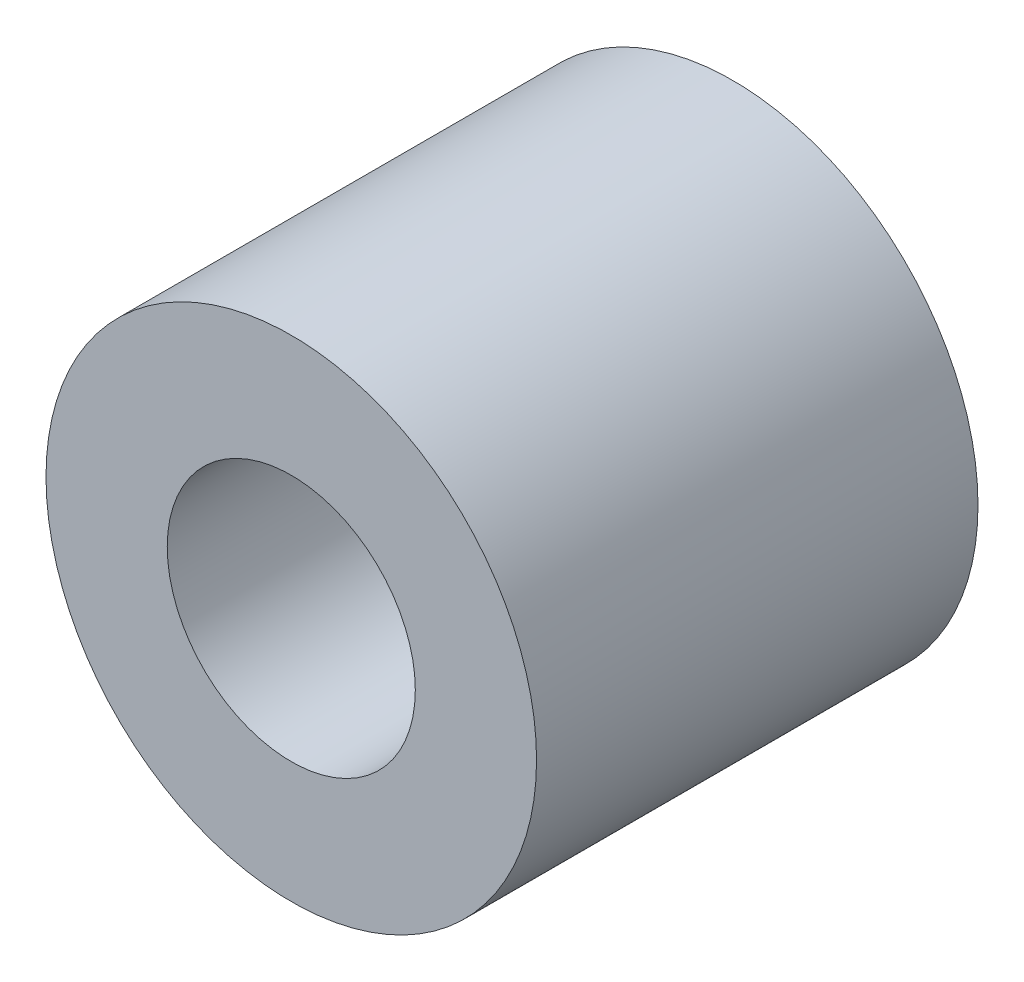
ISO-10303-21;
HEADER;
FILE_DESCRIPTION(('STEP AP214'),'2;1');
FILE_NAME('part.step','',(''),(''),'','','');
FILE_SCHEMA(('AUTOMOTIVE_DESIGN { 1 0 10303 214 1 1 1 1 }'));
ENDSEC;
DATA;
#1=APPLICATION_CONTEXT('core data for automotive mechanical design processes');
#2=APPLICATION_PROTOCOL_DEFINITION('international standard','automotive_design',2000,#1);
#3=PRODUCT_CONTEXT('',#1,'mechanical');
#4=PRODUCT('Part','Part','',(#3));
#5=PRODUCT_RELATED_PRODUCT_CATEGORY('part','',(#4));
#6=PRODUCT_DEFINITION_FORMATION('','',#4);
#7=PRODUCT_DEFINITION_CONTEXT('part definition',#1,'design');
#8=PRODUCT_DEFINITION('design','',#6,#7);
#9=PRODUCT_DEFINITION_SHAPE('','',#8);
#10=(LENGTH_UNIT() NAMED_UNIT(*) SI_UNIT(.MILLI.,.METRE.));
#11=(NAMED_UNIT(*) PLANE_ANGLE_UNIT() SI_UNIT($,.RADIAN.));
#12=(NAMED_UNIT(*) SI_UNIT($,.STERADIAN.) SOLID_ANGLE_UNIT());
#13=UNCERTAINTY_MEASURE_WITH_UNIT(LENGTH_MEASURE(1.E-05),#10,'distance_accuracy_value','');
#14=(GEOMETRIC_REPRESENTATION_CONTEXT(3) GLOBAL_UNCERTAINTY_ASSIGNED_CONTEXT((#13)) GLOBAL_UNIT_ASSIGNED_CONTEXT((#10,
#11,#12)) REPRESENTATION_CONTEXT('',''));
#15=CARTESIAN_POINT('',(0.,0.,0.));
#16=DIRECTION('',(0.,0.,1.));
#17=DIRECTION('',(1.,0.,0.));
#18=AXIS2_PLACEMENT_3D('',#15,#16,#17);
#19=CARTESIAN_POINT('',(0.,0.,4.));
#20=DIRECTION('',(0.,0.,-1.));
#21=DIRECTION('',(-1.,0.,0.));
#22=AXIS2_PLACEMENT_3D('',#19,#20,#21);
#23=CYLINDRICAL_SURFACE('',#22,4.445);
#24=CARTESIAN_POINT('',(0.,0.,4.));
#25=DIRECTION('',(0.,0.,1.));
#26=DIRECTION('',(1.,0.,0.));
#27=AXIS2_PLACEMENT_3D('',#24,#25,#26);
#28=CIRCLE('',#27,4.445);
#29=CARTESIAN_POINT('',(4.445,0.,4.));
#30=VERTEX_POINT('',#29);
#31=EDGE_CURVE('E10',#30,#30,#28,.T.);
#32=ORIENTED_EDGE('',*,*,#31,.F.);
#33=EDGE_LOOP('',(#32));
#34=FACE_BOUND('',#33,.T.);
#35=CARTESIAN_POINT('',(0.,0.,-4.));
#36=DIRECTION('',(0.,0.,1.));
#37=DIRECTION('',(1.,0.,0.));
#38=AXIS2_PLACEMENT_3D('',#35,#36,#37);
#39=CIRCLE('',#38,4.445);
#40=CARTESIAN_POINT('',(4.445,0.,-4.));
#41=VERTEX_POINT('',#40);
#42=EDGE_CURVE('E40',#41,#41,#39,.T.);
#43=ORIENTED_EDGE('',*,*,#42,.T.);
#44=EDGE_LOOP('',(#43));
#45=FACE_BOUND('',#44,.T.);
#46=ADVANCED_FACE('F37',(#34,#45),#23,.T.);
#47=CARTESIAN_POINT('',(0.,0.,4.));
#48=DIRECTION('',(0.,0.,1.));
#49=DIRECTION('',(1.,0.,0.));
#50=AXIS2_PLACEMENT_3D('',#47,#48,#49);
#51=PLANE('',#50);
#52=CARTESIAN_POINT('',(0.,0.,4.));
#53=DIRECTION('',(0.,0.,1.));
#54=DIRECTION('',(1.,0.,0.));
#55=AXIS2_PLACEMENT_3D('',#52,#53,#54);
#56=CIRCLE('',#55,2.24789999999999);
#57=CARTESIAN_POINT('',(2.24789999999999,0.,4.));
#58=VERTEX_POINT('',#57);
#59=EDGE_CURVE('E51',#58,#58,#56,.T.);
#60=ORIENTED_EDGE('',*,*,#59,.F.);
#61=EDGE_LOOP('',(#60));
#62=FACE_BOUND('',#61,.T.);
#63=ORIENTED_EDGE('',*,*,#31,.T.);
#64=EDGE_LOOP('',(#63));
#65=FACE_BOUND('',#64,.T.);
#66=ADVANCED_FACE('F57',(#62,#65),#51,.T.);
#67=CARTESIAN_POINT('',(0.,0.,-4.));
#68=DIRECTION('',(0.,0.,1.));
#69=DIRECTION('',(1.,0.,0.));
#70=AXIS2_PLACEMENT_3D('',#67,#68,#69);
#71=PLANE('',#70);
#72=CARTESIAN_POINT('',(0.,0.,-4.));
#73=DIRECTION('',(0.,0.,1.));
#74=DIRECTION('',(1.,0.,0.));
#75=AXIS2_PLACEMENT_3D('',#72,#73,#74);
#76=CIRCLE('',#75,2.2479);
#77=CARTESIAN_POINT('',(2.2479,0.,-4.));
#78=VERTEX_POINT('',#77);
#79=EDGE_CURVE('E47',#78,#78,#76,.T.);
#80=ORIENTED_EDGE('',*,*,#79,.T.);
#81=EDGE_LOOP('',(#80));
#82=FACE_BOUND('',#81,.T.);
#83=ORIENTED_EDGE('',*,*,#42,.F.);
#84=EDGE_LOOP('',(#83));
#85=FACE_BOUND('',#84,.T.);
#86=ADVANCED_FACE('F59',(#82,#85),#71,.F.);
#87=CARTESIAN_POINT('',(0.,0.,4.));
#88=DIRECTION('',(0.,0.,1.));
#89=DIRECTION('',(1.,0.,0.));
#90=AXIS2_PLACEMENT_3D('',#87,#88,#89);
#91=CYLINDRICAL_SURFACE('',#90,2.24789999999999);
#92=ORIENTED_EDGE('',*,*,#79,.F.);
#93=EDGE_LOOP('',(#92));
#94=FACE_BOUND('',#93,.T.);
#95=ORIENTED_EDGE('',*,*,#59,.T.);
#96=EDGE_LOOP('',(#95));
#97=FACE_BOUND('',#96,.T.);
#98=ADVANCED_FACE('F55',(#94,#97),#91,.F.);
#99=CLOSED_SHELL('',(#46,#66,#86,#98));
#100=MANIFOLD_SOLID_BREP('B2',#99);
#101=ADVANCED_BREP_SHAPE_REPRESENTATION('',(#18,#100),#14);
#102=SHAPE_DEFINITION_REPRESENTATION(#9,#101);
ENDSEC;
END-ISO-10303-21;
